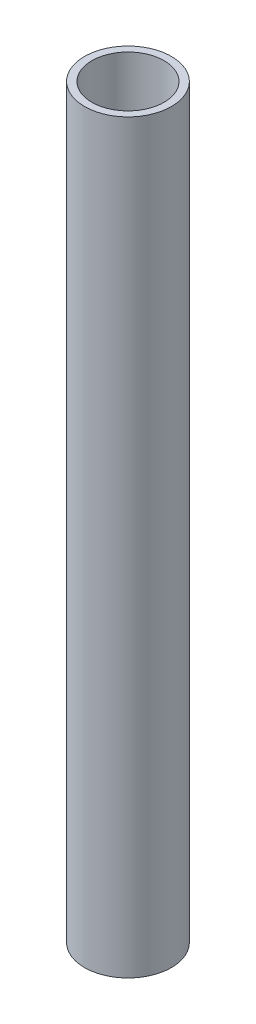
ISO-10303-21;
HEADER;
FILE_DESCRIPTION(('STEP AP214'),'2;1');
FILE_NAME('part.step','',(''),(''),'','','');
FILE_SCHEMA(('AUTOMOTIVE_DESIGN { 1 0 10303 214 1 1 1 1 }'));
ENDSEC;
DATA;
#1=APPLICATION_CONTEXT('core data for automotive mechanical design processes');
#2=APPLICATION_PROTOCOL_DEFINITION('international standard','automotive_design',2000,#1);
#3=PRODUCT_CONTEXT('',#1,'mechanical');
#4=PRODUCT('Part','Part','',(#3));
#5=PRODUCT_RELATED_PRODUCT_CATEGORY('part','',(#4));
#6=PRODUCT_DEFINITION_FORMATION('','',#4);
#7=PRODUCT_DEFINITION_CONTEXT('part definition',#1,'design');
#8=PRODUCT_DEFINITION('design','',#6,#7);
#9=PRODUCT_DEFINITION_SHAPE('','',#8);
#10=(LENGTH_UNIT() NAMED_UNIT(*) SI_UNIT(.MILLI.,.METRE.));
#11=(NAMED_UNIT(*) PLANE_ANGLE_UNIT() SI_UNIT($,.RADIAN.));
#12=(NAMED_UNIT(*) SI_UNIT($,.STERADIAN.) SOLID_ANGLE_UNIT());
#13=UNCERTAINTY_MEASURE_WITH_UNIT(LENGTH_MEASURE(1.E-05),#10,'distance_accuracy_value','');
#14=(GEOMETRIC_REPRESENTATION_CONTEXT(3) GLOBAL_UNCERTAINTY_ASSIGNED_CONTEXT((#13)) GLOBAL_UNIT_ASSIGNED_CONTEXT((#10,
#11,#12)) REPRESENTATION_CONTEXT('',''));
#15=CARTESIAN_POINT('',(0.,0.,0.));
#16=DIRECTION('',(0.,0.,1.));
#17=DIRECTION('',(1.,0.,0.));
#18=AXIS2_PLACEMENT_3D('',#15,#16,#17);
#19=CARTESIAN_POINT('',(0.,361.95,0.));
#20=DIRECTION('',(0.,1.,0.));
#21=DIRECTION('',(0.,0.,1.));
#22=AXIS2_PLACEMENT_3D('',#19,#20,#21);
#23=PLANE('',#22);
#24=CARTESIAN_POINT('',(0.,361.95,0.));
#25=DIRECTION('',(0.,1.,0.));
#26=DIRECTION('',(0.,0.,1.));
#27=AXIS2_PLACEMENT_3D('',#24,#25,#26);
#28=CIRCLE('',#27,21.082);
#29=CARTESIAN_POINT('',(0.,361.95,21.082));
#30=VERTEX_POINT('',#29);
#31=EDGE_CURVE('E10',#30,#30,#28,.T.);
#32=ORIENTED_EDGE('',*,*,#31,.T.);
#33=EDGE_LOOP('',(#32));
#34=FACE_BOUND('',#33,.T.);
#35=CARTESIAN_POINT('',(0.,361.95,0.));
#36=DIRECTION('',(0.,1.,0.));
#37=DIRECTION('',(0.,0.,1.));
#38=AXIS2_PLACEMENT_3D('',#35,#36,#37);
#39=CIRCLE('',#38,17.526);
#40=CARTESIAN_POINT('',(0.,361.95,17.526));
#41=VERTEX_POINT('',#40);
#42=EDGE_CURVE('E39',#41,#41,#39,.T.);
#43=ORIENTED_EDGE('',*,*,#42,.F.);
#44=EDGE_LOOP('',(#43));
#45=FACE_BOUND('',#44,.T.);
#46=ADVANCED_FACE('F28',(#34,#45),#23,.T.);
#47=CARTESIAN_POINT('',(0.,0.,0.));
#48=DIRECTION('',(0.,1.,0.));
#49=DIRECTION('',(0.,0.,1.));
#50=AXIS2_PLACEMENT_3D('',#47,#48,#49);
#51=PLANE('',#50);
#52=CARTESIAN_POINT('',(0.,0.,0.));
#53=DIRECTION('',(0.,1.,0.));
#54=DIRECTION('',(0.,0.,1.));
#55=AXIS2_PLACEMENT_3D('',#52,#53,#54);
#56=CIRCLE('',#55,21.082);
#57=CARTESIAN_POINT('',(0.,0.,21.082));
#58=VERTEX_POINT('',#57);
#59=EDGE_CURVE('E32',#58,#58,#56,.T.);
#60=ORIENTED_EDGE('',*,*,#59,.F.);
#61=EDGE_LOOP('',(#60));
#62=FACE_BOUND('',#61,.T.);
#63=CARTESIAN_POINT('',(0.,0.,0.));
#64=DIRECTION('',(0.,1.,0.));
#65=DIRECTION('',(0.,0.,1.));
#66=AXIS2_PLACEMENT_3D('',#63,#64,#65);
#67=CIRCLE('',#66,17.526);
#68=CARTESIAN_POINT('',(0.,0.,17.526));
#69=VERTEX_POINT('',#68);
#70=EDGE_CURVE('E41',#69,#69,#67,.T.);
#71=ORIENTED_EDGE('',*,*,#70,.T.);
#72=EDGE_LOOP('',(#71));
#73=FACE_BOUND('',#72,.T.);
#74=ADVANCED_FACE('F51',(#62,#73),#51,.F.);
#75=CARTESIAN_POINT('',(0.,361.95,0.));
#76=DIRECTION('',(0.,-1.,0.));
#77=DIRECTION('',(0.,0.,-1.));
#78=AXIS2_PLACEMENT_3D('',#75,#76,#77);
#79=CYLINDRICAL_SURFACE('',#78,21.082);
#80=ORIENTED_EDGE('',*,*,#31,.F.);
#81=EDGE_LOOP('',(#80));
#82=FACE_BOUND('',#81,.T.);
#83=ORIENTED_EDGE('',*,*,#59,.T.);
#84=EDGE_LOOP('',(#83));
#85=FACE_BOUND('',#84,.T.);
#86=ADVANCED_FACE('F30',(#82,#85),#79,.T.);
#87=CARTESIAN_POINT('',(0.,361.95,0.));
#88=DIRECTION('',(0.,-1.,0.));
#89=DIRECTION('',(0.,0.,-1.));
#90=AXIS2_PLACEMENT_3D('',#87,#88,#89);
#91=CYLINDRICAL_SURFACE('',#90,17.526);
#92=ORIENTED_EDGE('',*,*,#42,.T.);
#93=EDGE_LOOP('',(#92));
#94=FACE_BOUND('',#93,.T.);
#95=ORIENTED_EDGE('',*,*,#70,.F.);
#96=EDGE_LOOP('',(#95));
#97=FACE_BOUND('',#96,.T.);
#98=ADVANCED_FACE('F47',(#94,#97),#91,.F.);
#99=CLOSED_SHELL('',(#46,#74,#86,#98));
#100=MANIFOLD_SOLID_BREP('B2',#99);
#101=ADVANCED_BREP_SHAPE_REPRESENTATION('',(#18,#100),#14);
#102=SHAPE_DEFINITION_REPRESENTATION(#9,#101);
ENDSEC;
END-ISO-10303-21;
